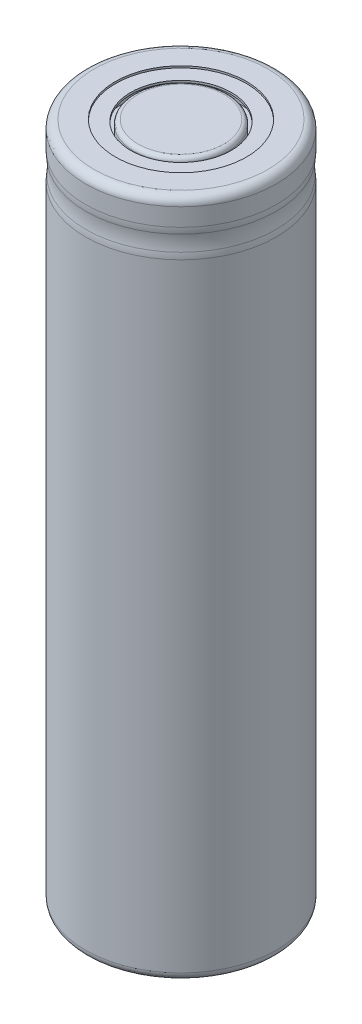
ISO-10303-21;
HEADER;
FILE_DESCRIPTION(('STEP AP214'),'2;1');
FILE_NAME('part.step','',(''),(''),'','','');
FILE_SCHEMA(('AUTOMOTIVE_DESIGN { 1 0 10303 214 1 1 1 1 }'));
ENDSEC;
DATA;
#1=APPLICATION_CONTEXT('core data for automotive mechanical design processes');
#2=APPLICATION_PROTOCOL_DEFINITION('international standard','automotive_design',2000,#1);
#3=PRODUCT_CONTEXT('',#1,'mechanical');
#4=PRODUCT('Part','Part','',(#3));
#5=PRODUCT_RELATED_PRODUCT_CATEGORY('part','',(#4));
#6=PRODUCT_DEFINITION_FORMATION('','',#4);
#7=PRODUCT_DEFINITION_CONTEXT('part definition',#1,'design');
#8=PRODUCT_DEFINITION('design','',#6,#7);
#9=PRODUCT_DEFINITION_SHAPE('','',#8);
#10=(LENGTH_UNIT() NAMED_UNIT(*) SI_UNIT(.MILLI.,.METRE.));
#11=(NAMED_UNIT(*) PLANE_ANGLE_UNIT() SI_UNIT($,.RADIAN.));
#12=(NAMED_UNIT(*) SI_UNIT($,.STERADIAN.) SOLID_ANGLE_UNIT());
#13=UNCERTAINTY_MEASURE_WITH_UNIT(LENGTH_MEASURE(1.E-05),#10,'distance_accuracy_value','');
#14=(GEOMETRIC_REPRESENTATION_CONTEXT(3) GLOBAL_UNCERTAINTY_ASSIGNED_CONTEXT((#13)) GLOBAL_UNIT_ASSIGNED_CONTEXT((#10,
#11,#12)) REPRESENTATION_CONTEXT('',''));
#15=CARTESIAN_POINT('',(0.,0.,0.));
#16=DIRECTION('',(0.,0.,1.));
#17=DIRECTION('',(1.,0.,0.));
#18=AXIS2_PLACEMENT_3D('',#15,#16,#17);
#19=CARTESIAN_POINT('',(0.,64.88,0.));
#20=DIRECTION('',(0.,1.,0.));
#21=DIRECTION('',(0.,0.,1.));
#22=AXIS2_PLACEMENT_3D('',#19,#20,#21);
#23=PLANE('',#22);
#24=CARTESIAN_POINT('',(0.,64.88,0.));
#25=DIRECTION('',(0.,1.,0.));
#26=DIRECTION('',(0.,0.,1.));
#27=AXIS2_PLACEMENT_3D('',#24,#25,#26);
#28=CIRCLE('',#27,4.1);
#29=CARTESIAN_POINT('',(0.,64.88,4.1));
#30=VERTEX_POINT('',#29);
#31=EDGE_CURVE('E64',#30,#30,#28,.T.);
#32=ORIENTED_EDGE('',*,*,#31,.T.);
#33=EDGE_LOOP('',(#32));
#34=FACE_BOUND('',#33,.T.);
#35=ADVANCED_FACE('F32',(#34),#23,.T.);
#36=CARTESIAN_POINT('',(0.,0.,0.));
#37=DIRECTION('',(0.,-1.,0.));
#38=DIRECTION('',(0.,0.,-1.));
#39=AXIS2_PLACEMENT_3D('',#36,#37,#38);
#40=CYLINDRICAL_SURFACE('',#39,4.5);
#41=CARTESIAN_POINT('',(0.,64.48,0.));
#42=DIRECTION('',(0.,1.,0.));
#43=DIRECTION('',(0.,0.,1.));
#44=AXIS2_PLACEMENT_3D('',#41,#42,#43);
#45=CIRCLE('',#44,4.5);
#46=CARTESIAN_POINT('',(0.,64.48,4.5));
#47=VERTEX_POINT('',#46);
#48=EDGE_CURVE('E67',#47,#47,#45,.F.);
#49=ORIENTED_EDGE('',*,*,#48,.T.);
#50=EDGE_LOOP('',(#49));
#51=FACE_BOUND('',#50,.T.);
#52=CARTESIAN_POINT('',(0.,63.1476339259586,0.));
#53=DIRECTION('',(0.,-1.,0.));
#54=DIRECTION('',(0.,0.,-1.));
#55=AXIS2_PLACEMENT_3D('',#52,#53,#54);
#56=CIRCLE('',#55,4.5);
#57=CARTESIAN_POINT('',(0.,63.1476339259586,-4.5));
#58=VERTEX_POINT('',#57);
#59=EDGE_CURVE('E70',#58,#58,#56,.T.);
#60=ORIENTED_EDGE('',*,*,#59,.F.);
#61=EDGE_LOOP('',(#60));
#62=FACE_BOUND('',#61,.T.);
#63=ADVANCED_FACE('F115',(#51,#62),#40,.T.);
#64=CARTESIAN_POINT('',(4.5,63.1476339259586,0.));
#65=DIRECTION('',(0.,1.,0.));
#66=DIRECTION('',(0.,0.,1.));
#67=AXIS2_PLACEMENT_3D('',#64,#65,#66);
#68=PLANE('',#67);
#69=ORIENTED_EDGE('',*,*,#59,.T.);
#70=EDGE_LOOP('',(#69));
#71=FACE_BOUND('',#70,.T.);
#72=CARTESIAN_POINT('',(0.,63.1476339259586,0.));
#73=DIRECTION('',(0.,-1.,0.));
#74=DIRECTION('',(0.,0.,-1.));
#75=AXIS2_PLACEMENT_3D('',#72,#73,#74);
#76=CIRCLE('',#75,5.78854051489799);
#77=CARTESIAN_POINT('',(0.,63.1476339259586,-5.78854051489799));
#78=VERTEX_POINT('',#77);
#79=EDGE_CURVE('E73',#78,#78,#76,.T.);
#80=ORIENTED_EDGE('',*,*,#79,.F.);
#81=EDGE_LOOP('',(#80));
#82=FACE_BOUND('',#81,.T.);
#83=ADVANCED_FACE('F121',(#71,#82),#68,.T.);
#84=CARTESIAN_POINT('',(0.,0.,0.));
#85=DIRECTION('',(0.,-1.,0.));
#86=DIRECTION('',(0.,0.,-1.));
#87=AXIS2_PLACEMENT_3D('',#84,#85,#86);
#88=CYLINDRICAL_SURFACE('',#87,5.78854051489799);
#89=ORIENTED_EDGE('',*,*,#79,.T.);
#90=EDGE_LOOP('',(#89));
#91=FACE_BOUND('',#90,.T.);
#92=CARTESIAN_POINT('',(0.,64.5,0.));
#93=DIRECTION('',(0.,-1.,0.));
#94=DIRECTION('',(0.,0.,-1.));
#95=AXIS2_PLACEMENT_3D('',#92,#93,#94);
#96=CIRCLE('',#95,5.78854051489799);
#97=CARTESIAN_POINT('',(0.,64.5,-5.78854051489799));
#98=VERTEX_POINT('',#97);
#99=EDGE_CURVE('E76',#98,#98,#96,.T.);
#100=ORIENTED_EDGE('',*,*,#99,.F.);
#101=EDGE_LOOP('',(#100));
#102=FACE_BOUND('',#101,.T.);
#103=ADVANCED_FACE('F295',(#91,#102),#88,.F.);
#104=CARTESIAN_POINT('',(4.8,64.5,0.));
#105=DIRECTION('',(0.,-1.,0.));
#106=DIRECTION('',(0.,0.,-1.));
#107=AXIS2_PLACEMENT_3D('',#104,#105,#106);
#108=PLANE('',#107);
#109=ORIENTED_EDGE('',*,*,#99,.T.);
#110=EDGE_LOOP('',(#109));
#111=FACE_BOUND('',#110,.T.);
#112=CARTESIAN_POINT('',(0.,64.5,0.));
#113=DIRECTION('',(0.,-1.,0.));
#114=DIRECTION('',(0.,0.,-1.));
#115=AXIS2_PLACEMENT_3D('',#112,#113,#114);
#116=CIRCLE('',#115,4.8);
#117=CARTESIAN_POINT('',(0.,64.5,-4.8));
#118=VERTEX_POINT('',#117);
#119=EDGE_CURVE('E79',#118,#118,#116,.T.);
#120=ORIENTED_EDGE('',*,*,#119,.F.);
#121=EDGE_LOOP('',(#120));
#122=FACE_BOUND('',#121,.T.);
#123=ADVANCED_FACE('F260',(#111,#122),#108,.T.);
#124=CARTESIAN_POINT('',(0.,0.,0.));
#125=DIRECTION('',(0.,-1.,0.));
#126=DIRECTION('',(0.,0.,-1.));
#127=AXIS2_PLACEMENT_3D('',#124,#125,#126);
#128=CYLINDRICAL_SURFACE('',#127,4.8);
#129=ORIENTED_EDGE('',*,*,#119,.T.);
#130=EDGE_LOOP('',(#129));
#131=FACE_BOUND('',#130,.T.);
#132=CARTESIAN_POINT('',(0.,64.7,0.));
#133=DIRECTION('',(0.,-1.,0.));
#134=DIRECTION('',(0.,0.,-1.));
#135=AXIS2_PLACEMENT_3D('',#132,#133,#134);
#136=CIRCLE('',#135,4.8);
#137=CARTESIAN_POINT('',(0.,64.7,-4.8));
#138=VERTEX_POINT('',#137);
#139=EDGE_CURVE('E82',#138,#138,#136,.T.);
#140=ORIENTED_EDGE('',*,*,#139,.F.);
#141=EDGE_LOOP('',(#140));
#142=FACE_BOUND('',#141,.T.);
#143=ADVANCED_FACE('F235',(#131,#142),#128,.F.);
#144=CARTESIAN_POINT('',(4.8,64.7,0.));
#145=DIRECTION('',(0.,1.,0.));
#146=DIRECTION('',(0.,0.,1.));
#147=AXIS2_PLACEMENT_3D('',#144,#145,#146);
#148=PLANE('',#147);
#149=ORIENTED_EDGE('',*,*,#139,.T.);
#150=EDGE_LOOP('',(#149));
#151=FACE_BOUND('',#150,.T.);
#152=CARTESIAN_POINT('',(0.,64.7,0.));
#153=DIRECTION('',(0.,-1.,0.));
#154=DIRECTION('',(0.,0.,-1.));
#155=AXIS2_PLACEMENT_3D('',#152,#153,#154);
#156=CIRCLE('',#155,6.25);
#157=CARTESIAN_POINT('',(0.,64.7,-6.25));
#158=VERTEX_POINT('',#157);
#159=EDGE_CURVE('E85',#158,#158,#156,.T.);
#160=ORIENTED_EDGE('',*,*,#159,.F.);
#161=EDGE_LOOP('',(#160));
#162=FACE_BOUND('',#161,.T.);
#163=ADVANCED_FACE('F259',(#151,#162),#148,.T.);
#164=CARTESIAN_POINT('',(0.,0.,0.));
#165=DIRECTION('',(0.,-1.,0.));
#166=DIRECTION('',(0.,0.,-1.));
#167=AXIS2_PLACEMENT_3D('',#164,#165,#166);
#168=CYLINDRICAL_SURFACE('',#167,6.25);
#169=ORIENTED_EDGE('',*,*,#159,.T.);
#170=EDGE_LOOP('',(#169));
#171=FACE_BOUND('',#170,.T.);
#172=CARTESIAN_POINT('',(0.,64.88,0.));
#173=DIRECTION('',(0.,-1.,0.));
#174=DIRECTION('',(0.,0.,-1.));
#175=AXIS2_PLACEMENT_3D('',#172,#173,#174);
#176=CIRCLE('',#175,6.25);
#177=CARTESIAN_POINT('',(0.,64.88,-6.25));
#178=VERTEX_POINT('',#177);
#179=EDGE_CURVE('E88',#178,#178,#176,.T.);
#180=ORIENTED_EDGE('',*,*,#179,.F.);
#181=EDGE_LOOP('',(#180));
#182=FACE_BOUND('',#181,.T.);
#183=ADVANCED_FACE('F200',(#171,#182),#168,.F.);
#184=CARTESIAN_POINT('',(6.25,64.88,0.));
#185=DIRECTION('',(0.,1.,0.));
#186=DIRECTION('',(0.,0.,1.));
#187=AXIS2_PLACEMENT_3D('',#184,#185,#186);
#188=PLANE('',#187);
#189=CARTESIAN_POINT('',(0.,64.88,0.));
#190=DIRECTION('',(0.,1.,0.));
#191=DIRECTION('',(0.,0.,1.));
#192=AXIS2_PLACEMENT_3D('',#189,#190,#191);
#193=CIRCLE('',#192,8.3);
#194=CARTESIAN_POINT('',(0.,64.88,8.3));
#195=VERTEX_POINT('',#194);
#196=EDGE_CURVE('E52',#195,#195,#193,.T.);
#197=ORIENTED_EDGE('',*,*,#196,.T.);
#198=EDGE_LOOP('',(#197));
#199=FACE_BOUND('',#198,.T.);
#200=ORIENTED_EDGE('',*,*,#179,.T.);
#201=EDGE_LOOP('',(#200));
#202=FACE_BOUND('',#201,.T.);
#203=ADVANCED_FACE('F194',(#199,#202),#188,.T.);
#204=CARTESIAN_POINT('',(0.,0.,0.));
#205=DIRECTION('',(0.,-1.,0.));
#206=DIRECTION('',(0.,0.,-1.));
#207=AXIS2_PLACEMENT_3D('',#204,#205,#206);
#208=CYLINDRICAL_SURFACE('',#207,9.1);
#209=CARTESIAN_POINT('',(0.,62.3816407864999,0.));
#210=DIRECTION('',(0.,1.,0.));
#211=DIRECTION('',(0.,0.,1.));
#212=AXIS2_PLACEMENT_3D('',#209,#210,#211);
#213=CIRCLE('',#212,9.1);
#214=CARTESIAN_POINT('',(0.,62.3816407864999,9.1));
#215=VERTEX_POINT('',#214);
#216=EDGE_CURVE('E10',#215,#215,#213,.T.);
#217=ORIENTED_EDGE('',*,*,#216,.T.);
#218=EDGE_LOOP('',(#217));
#219=FACE_BOUND('',#218,.T.);
#220=CARTESIAN_POINT('',(0.,64.08,0.));
#221=DIRECTION('',(0.,1.,0.));
#222=DIRECTION('',(0.,0.,1.));
#223=AXIS2_PLACEMENT_3D('',#220,#221,#222);
#224=CIRCLE('',#223,9.1);
#225=CARTESIAN_POINT('',(0.,64.08,9.1));
#226=VERTEX_POINT('',#225);
#227=EDGE_CURVE('E58',#226,#226,#224,.F.);
#228=ORIENTED_EDGE('',*,*,#227,.T.);
#229=EDGE_LOOP('',(#228));
#230=FACE_BOUND('',#229,.T.);
#231=ADVANCED_FACE('F130',(#219,#230),#208,.T.);
#232=CARTESIAN_POINT('',(0.,64.48,0.));
#233=DIRECTION('',(0.,1.,0.));
#234=DIRECTION('',(0.,0.,1.));
#235=AXIS2_PLACEMENT_3D('',#232,#233,#234);
#236=TOROIDAL_SURFACE('',#235,4.1,0.4);
#237=ORIENTED_EDGE('',*,*,#31,.F.);
#238=EDGE_LOOP('',(#237));
#239=FACE_BOUND('',#238,.T.);
#240=ORIENTED_EDGE('',*,*,#48,.F.);
#241=EDGE_LOOP('',(#240));
#242=FACE_BOUND('',#241,.T.);
#243=ADVANCED_FACE('F126',(#239,#242),#236,.T.);
#244=CARTESIAN_POINT('',(0.,64.08,0.));
#245=DIRECTION('',(0.,1.,0.));
#246=DIRECTION('',(0.,0.,1.));
#247=AXIS2_PLACEMENT_3D('',#244,#245,#246);
#248=TOROIDAL_SURFACE('',#247,8.3,0.8);
#249=ORIENTED_EDGE('',*,*,#196,.F.);
#250=EDGE_LOOP('',(#249));
#251=FACE_BOUND('',#250,.T.);
#252=ORIENTED_EDGE('',*,*,#227,.F.);
#253=EDGE_LOOP('',(#252));
#254=FACE_BOUND('',#253,.T.);
#255=ADVANCED_FACE('F129',(#251,#254),#248,.T.);
#256=CARTESIAN_POINT('',(0.,61.04,0.));
#257=DIRECTION('',(0.,-1.,0.));
#258=DIRECTION('',(0.,0.,-1.));
#259=AXIS2_PLACEMENT_3D('',#256,#257,#258);
#260=TOROIDAL_SURFACE('',#259,14.05,5.04999999999997);
#261=CARTESIAN_POINT('',(0.,60.291349616373,0.));
#262=DIRECTION('',(0.,1.,0.));
#263=DIRECTION('',(0.,0.,1.));
#264=AXIS2_PLACEMENT_3D('',#261,#262,#263);
#265=CIRCLE('',#264,9.05580110497238);
#266=CARTESIAN_POINT('',(0.,60.291349616373,9.05580110497238));
#267=VERTEX_POINT('',#266);
#268=EDGE_CURVE('E43',#267,#267,#265,.T.);
#269=ORIENTED_EDGE('',*,*,#268,.T.);
#270=EDGE_LOOP('',(#269));
#271=FACE_BOUND('',#270,.T.);
#272=CARTESIAN_POINT('',(0.,61.788650383627,0.));
#273=DIRECTION('',(0.,-1.,0.));
#274=DIRECTION('',(0.,0.,-1.));
#275=AXIS2_PLACEMENT_3D('',#272,#273,#274);
#276=CIRCLE('',#275,9.05580110497238);
#277=CARTESIAN_POINT('',(0.,61.788650383627,-9.05580110497238));
#278=VERTEX_POINT('',#277);
#279=EDGE_CURVE('E47',#278,#278,#276,.T.);
#280=ORIENTED_EDGE('',*,*,#279,.T.);
#281=EDGE_LOOP('',(#280));
#282=FACE_BOUND('',#281,.T.);
#283=ADVANCED_FACE('F112',(#271,#282),#260,.F.);
#284=CARTESIAN_POINT('',(7.,0.179999999999999,0.));
#285=DIRECTION('',(0.,-1.,0.));
#286=DIRECTION('',(0.,0.,-1.));
#287=AXIS2_PLACEMENT_3D('',#284,#285,#286);
#288=PLANE('',#287);
#289=CARTESIAN_POINT('',(0.,0.18,0.));
#290=DIRECTION('',(0.,-1.,0.));
#291=DIRECTION('',(0.,0.,-1.));
#292=AXIS2_PLACEMENT_3D('',#289,#290,#291);
#293=CIRCLE('',#292,7.);
#294=CARTESIAN_POINT('',(0.,0.18,-7.));
#295=VERTEX_POINT('',#294);
#296=EDGE_CURVE('E94',#295,#295,#293,.T.);
#297=ORIENTED_EDGE('',*,*,#296,.T.);
#298=EDGE_LOOP('',(#297));
#299=FACE_BOUND('',#298,.T.);
#300=ADVANCED_FACE('F98',(#299),#288,.T.);
#301=CARTESIAN_POINT('',(0.,0.,0.));
#302=DIRECTION('',(0.,-1.,0.));
#303=DIRECTION('',(0.,0.,-1.));
#304=AXIS2_PLACEMENT_3D('',#301,#302,#303);
#305=CYLINDRICAL_SURFACE('',#304,7.);
#306=CARTESIAN_POINT('',(0.,0.,0.));
#307=DIRECTION('',(0.,-1.,0.));
#308=DIRECTION('',(0.,0.,-1.));
#309=AXIS2_PLACEMENT_3D('',#306,#307,#308);
#310=CIRCLE('',#309,7.);
#311=CARTESIAN_POINT('',(0.,0.,-7.));
#312=VERTEX_POINT('',#311);
#313=EDGE_CURVE('E91',#312,#312,#310,.T.);
#314=ORIENTED_EDGE('',*,*,#313,.T.);
#315=EDGE_LOOP('',(#314));
#316=FACE_BOUND('',#315,.T.);
#317=ORIENTED_EDGE('',*,*,#296,.F.);
#318=EDGE_LOOP('',(#317));
#319=FACE_BOUND('',#318,.T.);
#320=ADVANCED_FACE('F100',(#316,#319),#305,.F.);
#321=CARTESIAN_POINT('',(9.10000000000001,0.,0.));
#322=DIRECTION('',(0.,-1.,0.));
#323=DIRECTION('',(0.,0.,-1.));
#324=AXIS2_PLACEMENT_3D('',#321,#322,#323);
#325=PLANE('',#324);
#326=CARTESIAN_POINT('',(0.,0.,0.));
#327=DIRECTION('',(0.,-1.,0.));
#328=DIRECTION('',(0.,0.,-1.));
#329=AXIS2_PLACEMENT_3D('',#326,#327,#328);
#330=CIRCLE('',#329,8.3);
#331=CARTESIAN_POINT('',(0.,0.,-8.3));
#332=VERTEX_POINT('',#331);
#333=EDGE_CURVE('E61',#332,#332,#330,.T.);
#334=ORIENTED_EDGE('',*,*,#333,.T.);
#335=EDGE_LOOP('',(#334));
#336=FACE_BOUND('',#335,.T.);
#337=ORIENTED_EDGE('',*,*,#313,.F.);
#338=EDGE_LOOP('',(#337));
#339=FACE_BOUND('',#338,.T.);
#340=ADVANCED_FACE('F102',(#336,#339),#325,.T.);
#341=CARTESIAN_POINT('',(0.,0.8,0.));
#342=DIRECTION('',(0.,-1.,0.));
#343=DIRECTION('',(0.,0.,-1.));
#344=AXIS2_PLACEMENT_3D('',#341,#342,#343);
#345=TOROIDAL_SURFACE('',#344,8.3,0.8);
#346=CARTESIAN_POINT('',(0.,0.8,0.));
#347=DIRECTION('',(0.,-1.,0.));
#348=DIRECTION('',(0.,0.,-1.));
#349=AXIS2_PLACEMENT_3D('',#346,#347,#348);
#350=CIRCLE('',#349,9.1);
#351=CARTESIAN_POINT('',(0.,0.8,-9.1));
#352=VERTEX_POINT('',#351);
#353=EDGE_CURVE('E55',#352,#352,#350,.F.);
#354=ORIENTED_EDGE('',*,*,#353,.F.);
#355=EDGE_LOOP('',(#354));
#356=FACE_BOUND('',#355,.T.);
#357=ORIENTED_EDGE('',*,*,#333,.F.);
#358=EDGE_LOOP('',(#357));
#359=FACE_BOUND('',#358,.T.);
#360=ADVANCED_FACE('F109',(#356,#359),#345,.T.);
#361=CARTESIAN_POINT('',(0.,59.6983592135001,0.));
#362=DIRECTION('',(0.,-1.,0.));
#363=DIRECTION('',(0.,0.,-1.));
#364=AXIS2_PLACEMENT_3D('',#361,#362,#363);
#365=CIRCLE('',#364,9.1);
#366=CARTESIAN_POINT('',(0.,59.6983592135001,-9.1));
#367=VERTEX_POINT('',#366);
#368=EDGE_CURVE('E39',#367,#367,#365,.T.);
#369=ORIENTED_EDGE('',*,*,#368,.T.);
#370=EDGE_LOOP('',(#369));
#371=FACE_BOUND('',#370,.T.);
#372=ORIENTED_EDGE('',*,*,#353,.T.);
#373=EDGE_LOOP('',(#372));
#374=FACE_BOUND('',#373,.T.);
#375=ADVANCED_FACE('F134',(#371,#374),#208,.T.);
#376=CARTESIAN_POINT('',(0.,59.6983592135001,0.));
#377=DIRECTION('',(0.,-1.,0.));
#378=DIRECTION('',(0.,0.,-1.));
#379=AXIS2_PLACEMENT_3D('',#376,#377,#378);
#380=TOROIDAL_SURFACE('',#379,5.1,4.);
#381=ORIENTED_EDGE('',*,*,#368,.F.);
#382=EDGE_LOOP('',(#381));
#383=FACE_BOUND('',#382,.T.);
#384=ORIENTED_EDGE('',*,*,#268,.F.);
#385=EDGE_LOOP('',(#384));
#386=FACE_BOUND('',#385,.T.);
#387=ADVANCED_FACE('F138',(#383,#386),#380,.T.);
#388=CARTESIAN_POINT('',(0.,62.3816407864999,0.));
#389=DIRECTION('',(0.,1.,0.));
#390=DIRECTION('',(0.,0.,1.));
#391=AXIS2_PLACEMENT_3D('',#388,#389,#390);
#392=TOROIDAL_SURFACE('',#391,5.1,4.);
#393=ORIENTED_EDGE('',*,*,#216,.F.);
#394=EDGE_LOOP('',(#393));
#395=FACE_BOUND('',#394,.T.);
#396=ORIENTED_EDGE('',*,*,#279,.F.);
#397=EDGE_LOOP('',(#396));
#398=FACE_BOUND('',#397,.T.);
#399=ADVANCED_FACE('F34',(#395,#398),#392,.T.);
#400=CLOSED_SHELL('',(#35,#63,#83,#103,#123,#143,#163,#183,#203,#231,#243,#255,#283,#300,#320,
#340,#360,#375,#387,#399));
#401=MANIFOLD_SOLID_BREP('B2',#400);
#402=ADVANCED_BREP_SHAPE_REPRESENTATION('',(#18,#401),#14);
#403=SHAPE_DEFINITION_REPRESENTATION(#9,#402);
ENDSEC;
END-ISO-10303-21;
